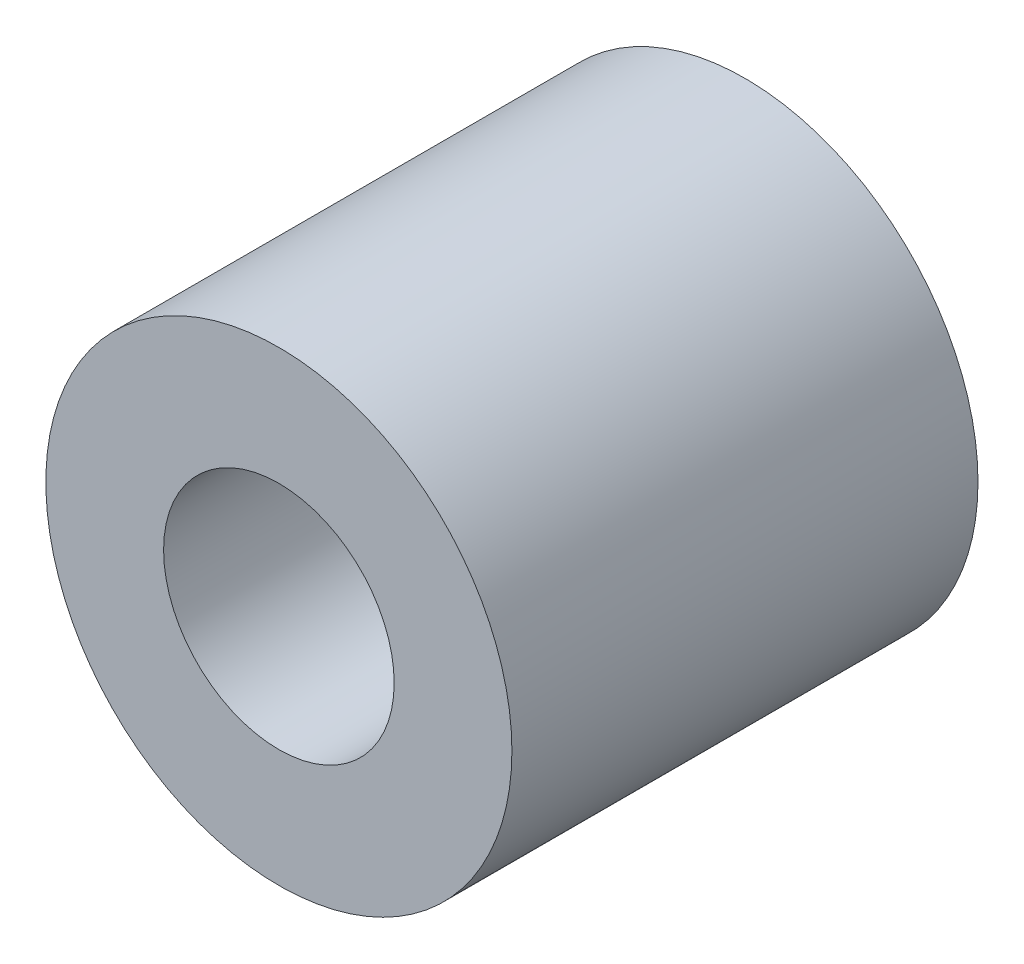
ISO-10303-21;
HEADER;
FILE_DESCRIPTION(('STEP AP214'),'2;1');
FILE_NAME('part.step','',(''),(''),'','','');
FILE_SCHEMA(('AUTOMOTIVE_DESIGN { 1 0 10303 214 1 1 1 1 }'));
ENDSEC;
DATA;
#1=APPLICATION_CONTEXT('core data for automotive mechanical design processes');
#2=APPLICATION_PROTOCOL_DEFINITION('international standard','automotive_design',2000,#1);
#3=PRODUCT_CONTEXT('',#1,'mechanical');
#4=PRODUCT('Part','Part','',(#3));
#5=PRODUCT_RELATED_PRODUCT_CATEGORY('part','',(#4));
#6=PRODUCT_DEFINITION_FORMATION('','',#4);
#7=PRODUCT_DEFINITION_CONTEXT('part definition',#1,'design');
#8=PRODUCT_DEFINITION('design','',#6,#7);
#9=PRODUCT_DEFINITION_SHAPE('','',#8);
#10=(LENGTH_UNIT() NAMED_UNIT(*) SI_UNIT(.MILLI.,.METRE.));
#11=(NAMED_UNIT(*) PLANE_ANGLE_UNIT() SI_UNIT($,.RADIAN.));
#12=(NAMED_UNIT(*) SI_UNIT($,.STERADIAN.) SOLID_ANGLE_UNIT());
#13=UNCERTAINTY_MEASURE_WITH_UNIT(LENGTH_MEASURE(1.E-05),#10,'distance_accuracy_value','');
#14=(GEOMETRIC_REPRESENTATION_CONTEXT(3) GLOBAL_UNCERTAINTY_ASSIGNED_CONTEXT((#13)) GLOBAL_UNIT_ASSIGNED_CONTEXT((#10,
#11,#12)) REPRESENTATION_CONTEXT('',''));
#15=CARTESIAN_POINT('',(0.,0.,0.));
#16=DIRECTION('',(0.,0.,1.));
#17=DIRECTION('',(1.,0.,0.));
#18=AXIS2_PLACEMENT_3D('',#15,#16,#17);
#19=CARTESIAN_POINT('',(0.,0.,-4.75));
#20=DIRECTION('',(0.,0.,1.));
#21=DIRECTION('',(1.,0.,0.));
#22=AXIS2_PLACEMENT_3D('',#19,#20,#21);
#23=CYLINDRICAL_SURFACE('',#22,4.75);
#24=CARTESIAN_POINT('',(0.,0.,-4.75));
#25=DIRECTION('',(0.,0.,1.));
#26=DIRECTION('',(1.,0.,0.));
#27=AXIS2_PLACEMENT_3D('',#24,#25,#26);
#28=CIRCLE('',#27,4.75);
#29=CARTESIAN_POINT('',(4.75,0.,-4.75));
#30=VERTEX_POINT('',#29);
#31=EDGE_CURVE('E9',#30,#30,#28,.T.);
#32=ORIENTED_EDGE('',*,*,#31,.T.);
#33=EDGE_LOOP('',(#32));
#34=FACE_BOUND('',#33,.T.);
#35=CARTESIAN_POINT('',(0.,0.,4.75));
#36=DIRECTION('',(0.,0.,1.));
#37=DIRECTION('',(1.,0.,0.));
#38=AXIS2_PLACEMENT_3D('',#35,#36,#37);
#39=CIRCLE('',#38,4.75);
#40=CARTESIAN_POINT('',(4.75,0.,4.75));
#41=VERTEX_POINT('',#40);
#42=EDGE_CURVE('E17',#41,#41,#39,.T.);
#43=ORIENTED_EDGE('',*,*,#42,.F.);
#44=EDGE_LOOP('',(#43));
#45=FACE_BOUND('',#44,.T.);
#46=ADVANCED_FACE('F14',(#34,#45),#23,.T.);
#47=CARTESIAN_POINT('',(0.,0.,-4.75));
#48=DIRECTION('',(0.,0.,1.));
#49=DIRECTION('',(1.,0.,0.));
#50=AXIS2_PLACEMENT_3D('',#47,#48,#49);
#51=PLANE('',#50);
#52=CARTESIAN_POINT('',(0.,0.,-4.75));
#53=DIRECTION('',(0.,0.,1.));
#54=DIRECTION('',(1.,0.,0.));
#55=AXIS2_PLACEMENT_3D('',#52,#53,#54);
#56=CIRCLE('',#55,2.35);
#57=CARTESIAN_POINT('',(2.35,0.,-4.75));
#58=VERTEX_POINT('',#57);
#59=EDGE_CURVE('E33',#58,#58,#56,.T.);
#60=ORIENTED_EDGE('',*,*,#59,.T.);
#61=EDGE_LOOP('',(#60));
#62=FACE_BOUND('',#61,.T.);
#63=ORIENTED_EDGE('',*,*,#31,.F.);
#64=EDGE_LOOP('',(#63));
#65=FACE_BOUND('',#64,.T.);
#66=ADVANCED_FACE('F42',(#62,#65),#51,.F.);
#67=CARTESIAN_POINT('',(0.,0.,4.75));
#68=DIRECTION('',(0.,0.,1.));
#69=DIRECTION('',(1.,0.,0.));
#70=AXIS2_PLACEMENT_3D('',#67,#68,#69);
#71=PLANE('',#70);
#72=CARTESIAN_POINT('',(0.,0.,4.75));
#73=DIRECTION('',(0.,0.,1.));
#74=DIRECTION('',(1.,0.,0.));
#75=AXIS2_PLACEMENT_3D('',#72,#73,#74);
#76=CIRCLE('',#75,2.35);
#77=CARTESIAN_POINT('',(2.35,0.,4.75));
#78=VERTEX_POINT('',#77);
#79=EDGE_CURVE('E28',#78,#78,#76,.T.);
#80=ORIENTED_EDGE('',*,*,#79,.F.);
#81=EDGE_LOOP('',(#80));
#82=FACE_BOUND('',#81,.T.);
#83=ORIENTED_EDGE('',*,*,#42,.T.);
#84=EDGE_LOOP('',(#83));
#85=FACE_BOUND('',#84,.T.);
#86=ADVANCED_FACE('F48',(#82,#85),#71,.T.);
#87=CARTESIAN_POINT('',(0.,0.,-4.75));
#88=DIRECTION('',(0.,0.,1.));
#89=DIRECTION('',(1.,0.,0.));
#90=AXIS2_PLACEMENT_3D('',#87,#88,#89);
#91=CYLINDRICAL_SURFACE('',#90,2.35);
#92=ORIENTED_EDGE('',*,*,#59,.F.);
#93=EDGE_LOOP('',(#92));
#94=FACE_BOUND('',#93,.T.);
#95=ORIENTED_EDGE('',*,*,#79,.T.);
#96=EDGE_LOOP('',(#95));
#97=FACE_BOUND('',#96,.T.);
#98=ADVANCED_FACE('F45',(#94,#97),#91,.F.);
#99=CLOSED_SHELL('',(#46,#66,#86,#98));
#100=MANIFOLD_SOLID_BREP('B1',#99);
#101=ADVANCED_BREP_SHAPE_REPRESENTATION('',(#18,#100),#14);
#102=SHAPE_DEFINITION_REPRESENTATION(#9,#101);
ENDSEC;
END-ISO-10303-21;
